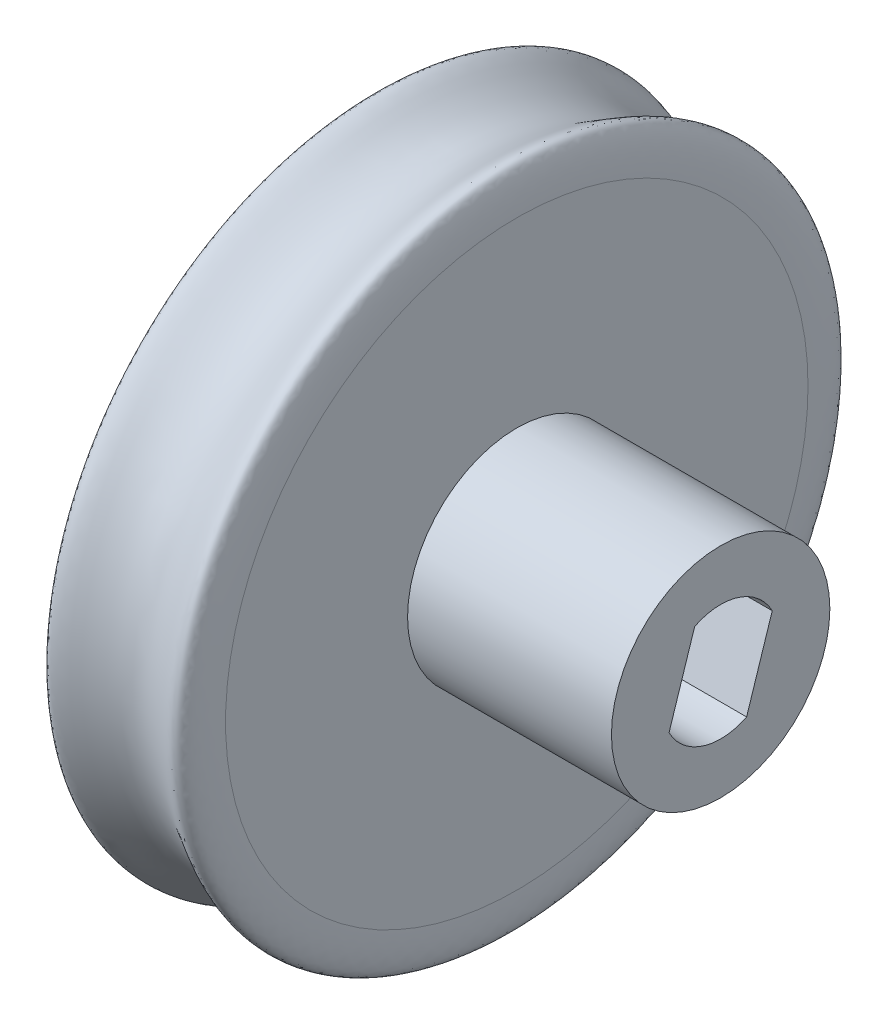
ISO-10303-21;
HEADER;
FILE_DESCRIPTION(('STEP AP214'),'2;1');
FILE_NAME('part.step','',(''),(''),'','','');
FILE_SCHEMA(('AUTOMOTIVE_DESIGN { 1 0 10303 214 1 1 1 1 }'));
ENDSEC;
DATA;
#1=APPLICATION_CONTEXT('core data for automotive mechanical design processes');
#2=APPLICATION_PROTOCOL_DEFINITION('international standard','automotive_design',2000,#1);
#3=PRODUCT_CONTEXT('',#1,'mechanical');
#4=PRODUCT('Part','Part','',(#3));
#5=PRODUCT_RELATED_PRODUCT_CATEGORY('part','',(#4));
#6=PRODUCT_DEFINITION_FORMATION('','',#4);
#7=PRODUCT_DEFINITION_CONTEXT('part definition',#1,'design');
#8=PRODUCT_DEFINITION('design','',#6,#7);
#9=PRODUCT_DEFINITION_SHAPE('','',#8);
#10=(LENGTH_UNIT() NAMED_UNIT(*) SI_UNIT(.MILLI.,.METRE.));
#11=(NAMED_UNIT(*) PLANE_ANGLE_UNIT() SI_UNIT($,.RADIAN.));
#12=(NAMED_UNIT(*) SI_UNIT($,.STERADIAN.) SOLID_ANGLE_UNIT());
#13=UNCERTAINTY_MEASURE_WITH_UNIT(LENGTH_MEASURE(1.E-05),#10,'distance_accuracy_value','');
#14=(GEOMETRIC_REPRESENTATION_CONTEXT(3) GLOBAL_UNCERTAINTY_ASSIGNED_CONTEXT((#13)) GLOBAL_UNIT_ASSIGNED_CONTEXT((#10,
#11,#12)) REPRESENTATION_CONTEXT('',''));
#15=CARTESIAN_POINT('',(0.,0.,0.));
#16=DIRECTION('',(0.,0.,1.));
#17=DIRECTION('',(1.,0.,0.));
#18=AXIS2_PLACEMENT_3D('',#15,#16,#17);
#19=CARTESIAN_POINT('',(3.175,0.,0.));
#20=DIRECTION('',(1.,0.,0.));
#21=DIRECTION('',(0.,0.,-1.));
#22=AXIS2_PLACEMENT_3D('',#19,#20,#21);
#23=PLANE('',#22);
#24=CARTESIAN_POINT('',(3.175,0.,0.));
#25=DIRECTION('',(1.,0.,0.));
#26=DIRECTION('',(0.,0.,-1.));
#27=AXIS2_PLACEMENT_3D('',#24,#25,#26);
#28=CIRCLE('',#27,12.7);
#29=CARTESIAN_POINT('',(3.175,0.,-12.7));
#30=VERTEX_POINT('',#29);
#31=EDGE_CURVE('E11',#30,#30,#28,.T.);
#32=ORIENTED_EDGE('',*,*,#31,.T.);
#33=EDGE_LOOP('',(#32));
#34=FACE_BOUND('',#33,.T.);
#35=CARTESIAN_POINT('',(3.175,0.,0.));
#36=DIRECTION('',(1.,0.,0.));
#37=DIRECTION('',(0.,0.,-1.));
#38=AXIS2_PLACEMENT_3D('',#35,#36,#37);
#39=CIRCLE('',#38,4.7625);
#40=CARTESIAN_POINT('',(3.175,0.,-4.7625));
#41=VERTEX_POINT('',#40);
#42=EDGE_CURVE('E132',#41,#41,#39,.T.);
#43=ORIENTED_EDGE('',*,*,#42,.F.);
#44=EDGE_LOOP('',(#43));
#45=FACE_BOUND('',#44,.T.);
#46=ADVANCED_FACE('F43',(#34,#45),#23,.T.);
#47=CARTESIAN_POINT('',(3.175,12.7,0.));
#48=CARTESIAN_POINT('',(3.175,19.05,0.));
#49=CARTESIAN_POINT('',(0.,6.35,0.));
#50=CARTESIAN_POINT('',(-3.175,19.05,0.));
#51=CARTESIAN_POINT('',(-3.175,12.7,0.));
#52=B_SPLINE_CURVE_WITH_KNOTS('',4,(#47,#48,#49,#50,#51),.UNSPECIFIED.,.F.,.F.,(5,5),(0.,1.),.UNSPECIFIED.);
#53=CARTESIAN_POINT('',(0.,0.,0.));
#54=DIRECTION('',(1.,0.,0.));
#55=AXIS1_PLACEMENT('',#53,#54);
#56=SURFACE_OF_REVOLUTION('',#52,#55);
#57=CARTESIAN_POINT('',(-3.175,0.,0.));
#58=DIRECTION('',(1.,0.,0.));
#59=DIRECTION('',(0.,0.,-1.));
#60=AXIS2_PLACEMENT_3D('',#57,#58,#59);
#61=CIRCLE('',#60,12.7);
#62=CARTESIAN_POINT('',(-3.175,0.,-12.7));
#63=VERTEX_POINT('',#62);
#64=EDGE_CURVE('E51',#63,#63,#61,.T.);
#65=ORIENTED_EDGE('',*,*,#64,.T.);
#66=EDGE_LOOP('',(#65));
#67=FACE_BOUND('',#66,.T.);
#68=ORIENTED_EDGE('',*,*,#31,.F.);
#69=EDGE_LOOP('',(#68));
#70=FACE_BOUND('',#69,.T.);
#71=ADVANCED_FACE('F146',(#67,#70),#56,.F.);
#72=CARTESIAN_POINT('',(-3.175,0.,0.));
#73=DIRECTION('',(-1.,0.,0.));
#74=DIRECTION('',(0.,0.,1.));
#75=AXIS2_PLACEMENT_3D('',#72,#73,#74);
#76=PLANE('',#75);
#77=ORIENTED_EDGE('',*,*,#64,.F.);
#78=EDGE_LOOP('',(#77));
#79=FACE_BOUND('',#78,.T.);
#80=ADVANCED_FACE('F149',(#79),#76,.T.);
#81=CARTESIAN_POINT('',(12.065,0.,0.));
#82=DIRECTION('',(1.,0.,0.));
#83=DIRECTION('',(0.,0.,-1.));
#84=AXIS2_PLACEMENT_3D('',#81,#82,#83);
#85=PLANE('',#84);
#86=CARTESIAN_POINT('',(12.065,0.,0.));
#87=DIRECTION('',(1.,0.,0.));
#88=DIRECTION('',(0.,0.,-1.));
#89=AXIS2_PLACEMENT_3D('',#86,#87,#88);
#90=CIRCLE('',#89,4.7625);
#91=CARTESIAN_POINT('',(12.065,0.,-4.7625));
#92=VERTEX_POINT('',#91);
#93=EDGE_CURVE('E133',#92,#92,#90,.T.);
#94=ORIENTED_EDGE('',*,*,#93,.T.);
#95=EDGE_LOOP('',(#94));
#96=FACE_BOUND('',#95,.T.);
#97=DIRECTION('',(0.,0.951367588803743,-0.308057966905179));
#98=VECTOR('',#97,1.);
#99=CARTESIAN_POINT('',(12.065,-2.27343444550492,-1.13273819657914));
#100=LINE('',#99,#98);
#101=CARTESIAN_POINT('',(12.065,-2.27343444550492,-1.13273819657914));
#102=VERTEX_POINT('',#101);
#103=CARTESIAN_POINT('',(12.065,1.17798031519116,-2.25032494920698));
#104=VERTEX_POINT('',#103);
#105=EDGE_CURVE('E119',#102,#104,#100,.T.);
#106=ORIENTED_EDGE('',*,*,#105,.F.);
#107=CARTESIAN_POINT('',(12.065,5.27355936696949E-13,0.));
#108=DIRECTION('',(1.,0.,0.));
#109=DIRECTION('',(0.,0.,-1.));
#110=AXIS2_PLACEMENT_3D('',#107,#108,#109);
#111=CIRCLE('',#110,2.54);
#112=CARTESIAN_POINT('',(12.065,-1.17798031519011,2.25032494920696));
#113=VERTEX_POINT('',#112);
#114=EDGE_CURVE('E116',#113,#102,#111,.T.);
#115=ORIENTED_EDGE('',*,*,#114,.F.);
#116=DIRECTION('',(0.,-0.951367588803744,0.308057966905176));
#117=VECTOR('',#116,1.);
#118=CARTESIAN_POINT('',(12.065,2.27343444550597,1.13273819657913));
#119=LINE('',#118,#117);
#120=CARTESIAN_POINT('',(12.065,2.27343444550597,1.13273819657913));
#121=VERTEX_POINT('',#120);
#122=EDGE_CURVE('E68',#121,#113,#119,.T.);
#123=ORIENTED_EDGE('',*,*,#122,.F.);
#124=CARTESIAN_POINT('',(12.065,5.27355936696949E-13,0.));
#125=DIRECTION('',(1.,0.,0.));
#126=DIRECTION('',(0.,0.,-1.));
#127=AXIS2_PLACEMENT_3D('',#124,#125,#126);
#128=CIRCLE('',#127,2.54);
#129=EDGE_CURVE('E93',#104,#121,#128,.T.);
#130=ORIENTED_EDGE('',*,*,#129,.F.);
#131=EDGE_LOOP('',(#106,#115,#123,#130));
#132=FACE_BOUND('',#131,.T.);
#133=ADVANCED_FACE('F153',(#96,#132),#85,.T.);
#134=CARTESIAN_POINT('',(12.065,0.,0.));
#135=DIRECTION('',(-1.,0.,0.));
#136=DIRECTION('',(0.,0.,1.));
#137=AXIS2_PLACEMENT_3D('',#134,#135,#136);
#138=CYLINDRICAL_SURFACE('',#137,4.7625);
#139=ORIENTED_EDGE('',*,*,#93,.F.);
#140=EDGE_LOOP('',(#139));
#141=FACE_BOUND('',#140,.T.);
#142=ORIENTED_EDGE('',*,*,#42,.T.);
#143=EDGE_LOOP('',(#142));
#144=FACE_BOUND('',#143,.T.);
#145=ADVANCED_FACE('F155',(#141,#144),#138,.T.);
#146=CARTESIAN_POINT('',(12.065,5.27355936696949E-13,0.));
#147=DIRECTION('',(-1.,0.,0.));
#148=DIRECTION('',(0.,0.,1.));
#149=AXIS2_PLACEMENT_3D('',#146,#147,#148);
#150=CYLINDRICAL_SURFACE('',#149,2.54);
#151=DIRECTION('',(-1.,0.,0.));
#152=VECTOR('',#151,1.);
#153=CARTESIAN_POINT('',(12.065,-2.27343444550492,-1.13273819657914));
#154=LINE('',#153,#152);
#155=CARTESIAN_POINT('',(0.,-2.27343444550492,-1.13273819657914));
#156=VERTEX_POINT('',#155);
#157=EDGE_CURVE('E129',#102,#156,#154,.T.);
#158=ORIENTED_EDGE('',*,*,#157,.T.);
#159=CARTESIAN_POINT('',(0.,5.27355936696949E-13,0.));
#160=DIRECTION('',(1.,0.,0.));
#161=DIRECTION('',(0.,0.,-1.));
#162=AXIS2_PLACEMENT_3D('',#159,#160,#161);
#163=CIRCLE('',#162,2.54);
#164=CARTESIAN_POINT('',(0.,-1.17798031519011,2.25032494920696));
#165=VERTEX_POINT('',#164);
#166=EDGE_CURVE('E104',#165,#156,#163,.T.);
#167=ORIENTED_EDGE('',*,*,#166,.F.);
#168=DIRECTION('',(-1.,0.,0.));
#169=VECTOR('',#168,1.);
#170=CARTESIAN_POINT('',(12.065,-1.17798031519011,2.25032494920696));
#171=LINE('',#170,#169);
#172=EDGE_CURVE('E96',#113,#165,#171,.T.);
#173=ORIENTED_EDGE('',*,*,#172,.F.);
#174=ORIENTED_EDGE('',*,*,#114,.T.);
#175=EDGE_LOOP('',(#158,#167,#173,#174));
#176=FACE_BOUND('',#175,.T.);
#177=ADVANCED_FACE('F158',(#176),#150,.F.);
#178=CARTESIAN_POINT('',(12.065,-2.27343444550492,-1.13273819657914));
#179=DIRECTION('',(0.,0.308057966905179,0.951367588803743));
#180=DIRECTION('',(0.,-0.951367588803743,0.308057966905179));
#181=AXIS2_PLACEMENT_3D('',#178,#179,#180);
#182=PLANE('',#181);
#183=DIRECTION('',(-1.,0.,0.));
#184=VECTOR('',#183,1.);
#185=CARTESIAN_POINT('',(12.065,1.17798031519116,-2.25032494920698));
#186=LINE('',#185,#184);
#187=CARTESIAN_POINT('',(0.,1.17798031519116,-2.25032494920698));
#188=VERTEX_POINT('',#187);
#189=EDGE_CURVE('E95',#104,#188,#186,.T.);
#190=ORIENTED_EDGE('',*,*,#189,.T.);
#191=DIRECTION('',(0.,0.951367588803743,-0.308057966905179));
#192=VECTOR('',#191,1.);
#193=CARTESIAN_POINT('',(0.,-2.27343444550492,-1.13273819657914));
#194=LINE('',#193,#192);
#195=EDGE_CURVE('E108',#156,#188,#194,.T.);
#196=ORIENTED_EDGE('',*,*,#195,.F.);
#197=ORIENTED_EDGE('',*,*,#157,.F.);
#198=ORIENTED_EDGE('',*,*,#105,.T.);
#199=EDGE_LOOP('',(#190,#196,#197,#198));
#200=FACE_BOUND('',#199,.T.);
#201=ADVANCED_FACE('F165',(#200),#182,.T.);
#202=CARTESIAN_POINT('',(12.065,5.27355936696949E-13,0.));
#203=DIRECTION('',(-1.,0.,0.));
#204=DIRECTION('',(0.,0.,1.));
#205=AXIS2_PLACEMENT_3D('',#202,#203,#204);
#206=CYLINDRICAL_SURFACE('',#205,2.54);
#207=DIRECTION('',(-1.,0.,0.));
#208=VECTOR('',#207,1.);
#209=CARTESIAN_POINT('',(12.065,2.27343444550597,1.13273819657913));
#210=LINE('',#209,#208);
#211=CARTESIAN_POINT('',(0.,2.27343444550597,1.13273819657913));
#212=VERTEX_POINT('',#211);
#213=EDGE_CURVE('E61',#121,#212,#210,.T.);
#214=ORIENTED_EDGE('',*,*,#213,.T.);
#215=CARTESIAN_POINT('',(0.,5.27355936696949E-13,0.));
#216=DIRECTION('',(1.,0.,0.));
#217=DIRECTION('',(0.,0.,-1.));
#218=AXIS2_PLACEMENT_3D('',#215,#216,#217);
#219=CIRCLE('',#218,2.54);
#220=EDGE_CURVE('E90',#188,#212,#219,.T.);
#221=ORIENTED_EDGE('',*,*,#220,.F.);
#222=ORIENTED_EDGE('',*,*,#189,.F.);
#223=ORIENTED_EDGE('',*,*,#129,.T.);
#224=EDGE_LOOP('',(#214,#221,#222,#223));
#225=FACE_BOUND('',#224,.T.);
#226=ADVANCED_FACE('F87',(#225),#206,.F.);
#227=CARTESIAN_POINT('',(12.065,2.27343444550597,1.13273819657913));
#228=DIRECTION('',(0.,-0.308057966905176,-0.951367588803744));
#229=DIRECTION('',(0.,0.951367588803744,-0.308057966905176));
#230=AXIS2_PLACEMENT_3D('',#227,#228,#229);
#231=PLANE('',#230);
#232=ORIENTED_EDGE('',*,*,#172,.T.);
#233=DIRECTION('',(0.,-0.951367588803744,0.308057966905176));
#234=VECTOR('',#233,1.);
#235=CARTESIAN_POINT('',(0.,2.27343444550597,1.13273819657913));
#236=LINE('',#235,#234);
#237=EDGE_CURVE('E99',#212,#165,#236,.T.);
#238=ORIENTED_EDGE('',*,*,#237,.F.);
#239=ORIENTED_EDGE('',*,*,#213,.F.);
#240=ORIENTED_EDGE('',*,*,#122,.T.);
#241=EDGE_LOOP('',(#232,#238,#239,#240));
#242=FACE_BOUND('',#241,.T.);
#243=ADVANCED_FACE('F100',(#242),#231,.T.);
#244=CARTESIAN_POINT('',(0.,5.27355936696949E-13,0.));
#245=DIRECTION('',(1.,0.,0.));
#246=DIRECTION('',(0.,0.,-1.));
#247=AXIS2_PLACEMENT_3D('',#244,#245,#246);
#248=PLANE('',#247);
#249=ORIENTED_EDGE('',*,*,#220,.T.);
#250=ORIENTED_EDGE('',*,*,#237,.T.);
#251=ORIENTED_EDGE('',*,*,#166,.T.);
#252=ORIENTED_EDGE('',*,*,#195,.T.);
#253=EDGE_LOOP('',(#249,#250,#251,#252));
#254=FACE_BOUND('',#253,.T.);
#255=ADVANCED_FACE('F106',(#254),#248,.T.);
#256=CLOSED_SHELL('',(#46,#71,#80,#133,#145,#177,#201,#226,#243,#255));
#257=MANIFOLD_SOLID_BREP('B2',#256);
#258=ADVANCED_BREP_SHAPE_REPRESENTATION('',(#18,#257),#14);
#259=SHAPE_DEFINITION_REPRESENTATION(#9,#258);
ENDSEC;
END-ISO-10303-21;
